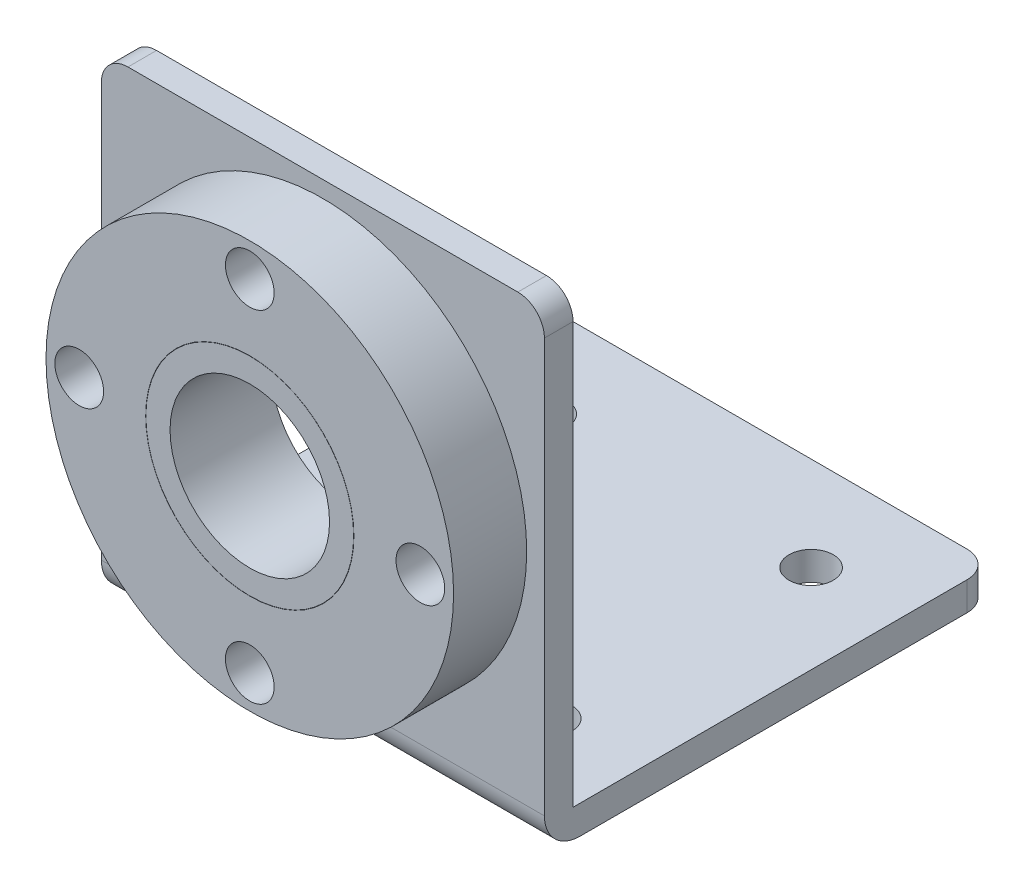
ISO-10303-21;
HEADER;
FILE_DESCRIPTION(('STEP AP214'),'2;1');
FILE_NAME('part.step','',(''),(''),'','','');
FILE_SCHEMA(('AUTOMOTIVE_DESIGN { 1 0 10303 214 1 1 1 1 }'));
ENDSEC;
DATA;
#1=APPLICATION_CONTEXT('core data for automotive mechanical design processes');
#2=APPLICATION_PROTOCOL_DEFINITION('international standard','automotive_design',2000,#1);
#3=PRODUCT_CONTEXT('',#1,'mechanical');
#4=PRODUCT('Part','Part','',(#3));
#5=PRODUCT_RELATED_PRODUCT_CATEGORY('part','',(#4));
#6=PRODUCT_DEFINITION_FORMATION('','',#4);
#7=PRODUCT_DEFINITION_CONTEXT('part definition',#1,'design');
#8=PRODUCT_DEFINITION('design','',#6,#7);
#9=PRODUCT_DEFINITION_SHAPE('','',#8);
#10=(LENGTH_UNIT() NAMED_UNIT(*) SI_UNIT(.MILLI.,.METRE.));
#11=(NAMED_UNIT(*) PLANE_ANGLE_UNIT() SI_UNIT($,.RADIAN.));
#12=(NAMED_UNIT(*) SI_UNIT($,.STERADIAN.) SOLID_ANGLE_UNIT());
#13=UNCERTAINTY_MEASURE_WITH_UNIT(LENGTH_MEASURE(1.E-05),#10,'distance_accuracy_value','');
#14=(GEOMETRIC_REPRESENTATION_CONTEXT(3) GLOBAL_UNCERTAINTY_ASSIGNED_CONTEXT((#13)) GLOBAL_UNIT_ASSIGNED_CONTEXT((#10,
#11,#12)) REPRESENTATION_CONTEXT('',''));
#15=CARTESIAN_POINT('',(0.,0.,0.));
#16=DIRECTION('',(0.,0.,1.));
#17=DIRECTION('',(1.,0.,0.));
#18=AXIS2_PLACEMENT_3D('',#15,#16,#17);
#19=CARTESIAN_POINT('',(0.,28.85,66.7633080376491));
#20=DIRECTION('',(0.,0.,-1.));
#21=DIRECTION('',(-1.,0.,0.));
#22=AXIS2_PLACEMENT_3D('',#19,#20,#21);
#23=CYLINDRICAL_SURFACE('',#22,11.725);
#24=CARTESIAN_POINT('',(0.,28.85,22.12));
#25=DIRECTION('',(0.,0.,-1.));
#26=DIRECTION('',(-1.,0.,0.));
#27=AXIS2_PLACEMENT_3D('',#24,#25,#26);
#28=CIRCLE('',#27,11.725);
#29=CARTESIAN_POINT('',(-11.725,28.85,22.12));
#30=VERTEX_POINT('',#29);
#31=EDGE_CURVE('E51',#30,#30,#28,.T.);
#32=ORIENTED_EDGE('',*,*,#31,.F.);
#33=EDGE_LOOP('',(#32));
#34=FACE_BOUND('',#33,.T.);
#35=CARTESIAN_POINT('',(0.,28.85,33.6));
#36=DIRECTION('',(0.,0.,1.));
#37=DIRECTION('',(1.,0.,0.));
#38=AXIS2_PLACEMENT_3D('',#35,#36,#37);
#39=CIRCLE('',#38,11.725);
#40=CARTESIAN_POINT('',(11.725,28.85,33.6));
#41=VERTEX_POINT('',#40);
#42=EDGE_CURVE('E47',#41,#41,#39,.F.);
#43=ORIENTED_EDGE('',*,*,#42,.T.);
#44=EDGE_LOOP('',(#43));
#45=FACE_BOUND('',#44,.T.);
#46=ADVANCED_FACE('F43',(#34,#45),#23,.T.);
#47=CARTESIAN_POINT('',(0.,28.85,66.7633080376491));
#48=DIRECTION('',(0.,0.,-1.));
#49=DIRECTION('',(-1.,0.,0.));
#50=AXIS2_PLACEMENT_3D('',#47,#48,#49);
#51=CYLINDRICAL_SURFACE('',#50,9.);
#52=CARTESIAN_POINT('',(0.,28.85,22.12));
#53=DIRECTION('',(0.,0.,-1.));
#54=DIRECTION('',(-1.,0.,0.));
#55=AXIS2_PLACEMENT_3D('',#52,#53,#54);
#56=CIRCLE('',#55,9.);
#57=CARTESIAN_POINT('',(-9.,28.85,22.12));
#58=VERTEX_POINT('',#57);
#59=EDGE_CURVE('E55',#58,#58,#56,.T.);
#60=ORIENTED_EDGE('',*,*,#59,.T.);
#61=EDGE_LOOP('',(#60));
#62=FACE_BOUND('',#61,.T.);
#63=CARTESIAN_POINT('',(0.,28.85,33.6));
#64=DIRECTION('',(0.,0.,1.));
#65=DIRECTION('',(1.,0.,0.));
#66=AXIS2_PLACEMENT_3D('',#63,#64,#65);
#67=CIRCLE('',#66,9.);
#68=CARTESIAN_POINT('',(9.,28.85,33.6));
#69=VERTEX_POINT('',#68);
#70=EDGE_CURVE('E11',#69,#69,#67,.F.);
#71=ORIENTED_EDGE('',*,*,#70,.F.);
#72=EDGE_LOOP('',(#71));
#73=FACE_BOUND('',#72,.T.);
#74=ADVANCED_FACE('F70',(#62,#73),#51,.F.);
#75=CARTESIAN_POINT('',(0.,28.85,22.12));
#76=DIRECTION('',(0.,0.,-1.));
#77=DIRECTION('',(-1.,0.,0.));
#78=AXIS2_PLACEMENT_3D('',#75,#76,#77);
#79=PLANE('',#78);
#80=ORIENTED_EDGE('',*,*,#59,.F.);
#81=EDGE_LOOP('',(#80));
#82=FACE_BOUND('',#81,.T.);
#83=ORIENTED_EDGE('',*,*,#31,.T.);
#84=EDGE_LOOP('',(#83));
#85=FACE_BOUND('',#84,.T.);
#86=ADVANCED_FACE('F66',(#82,#85),#79,.T.);
#87=CARTESIAN_POINT('',(0.,0.,33.6));
#88=DIRECTION('',(0.,0.,1.));
#89=DIRECTION('',(1.,0.,0.));
#90=AXIS2_PLACEMENT_3D('',#87,#88,#89);
#91=PLANE('',#90);
#92=ORIENTED_EDGE('',*,*,#42,.F.);
#93=EDGE_LOOP('',(#92));
#94=FACE_BOUND('',#93,.T.);
#95=ORIENTED_EDGE('',*,*,#70,.T.);
#96=EDGE_LOOP('',(#95));
#97=FACE_BOUND('',#96,.T.);
#98=ADVANCED_FACE('F45',(#94,#97),#91,.T.);
#99=CLOSED_SHELL('',(#46,#74,#86,#98));
#100=MANIFOLD_SOLID_BREP('B2',#99);
#101=CARTESIAN_POINT('',(-25.,3.23,25.35));
#102=DIRECTION('',(0.,0.,-1.));
#103=DIRECTION('',(-1.,0.,0.));
#104=AXIS2_PLACEMENT_3D('',#101,#102,#103);
#105=PLANE('',#104);
#106=DIRECTION('',(1.,0.,0.));
#107=VECTOR('',#106,1.);
#108=CARTESIAN_POINT('',(-25.,53.7,25.35));
#109=LINE('',#108,#107);
#110=CARTESIAN_POINT('',(-22.,53.7,25.35));
#111=VERTEX_POINT('',#110);
#112=CARTESIAN_POINT('',(22.,53.7,25.35));
#113=VERTEX_POINT('',#112);
#114=EDGE_CURVE('E215',#111,#113,#109,.T.);
#115=ORIENTED_EDGE('',*,*,#114,.F.);
#116=CARTESIAN_POINT('',(-22.,50.7,25.35));
#117=DIRECTION('',(0.,0.,-1.));
#118=DIRECTION('',(-1.,0.,0.));
#119=AXIS2_PLACEMENT_3D('',#116,#117,#118);
#120=CIRCLE('',#119,3.);
#121=CARTESIAN_POINT('',(-25.,50.7,25.35));
#122=VERTEX_POINT('',#121);
#123=EDGE_CURVE('E300',#111,#122,#120,.F.);
#124=ORIENTED_EDGE('',*,*,#123,.T.);
#125=DIRECTION('',(0.,-1.,0.));
#126=VECTOR('',#125,1.);
#127=CARTESIAN_POINT('',(-25.,3.23,25.35));
#128=LINE('',#127,#126);
#129=CARTESIAN_POINT('',(-25.,4.,25.35));
#130=VERTEX_POINT('',#129);
#131=EDGE_CURVE('E261',#122,#130,#128,.T.);
#132=ORIENTED_EDGE('',*,*,#131,.T.);
#133=DIRECTION('',(1.,0.,0.));
#134=VECTOR('',#133,1.);
#135=CARTESIAN_POINT('',(25.,4.,25.35));
#136=LINE('',#135,#134);
#137=CARTESIAN_POINT('',(25.,4.,25.35));
#138=VERTEX_POINT('',#137);
#139=EDGE_CURVE('E263',#130,#138,#136,.T.);
#140=ORIENTED_EDGE('',*,*,#139,.T.);
#141=DIRECTION('',(0.,-1.,0.));
#142=VECTOR('',#141,1.);
#143=CARTESIAN_POINT('',(25.,3.23,25.35));
#144=LINE('',#143,#142);
#145=CARTESIAN_POINT('',(25.,50.7,25.35));
#146=VERTEX_POINT('',#145);
#147=EDGE_CURVE('E202',#146,#138,#144,.T.);
#148=ORIENTED_EDGE('',*,*,#147,.F.);
#149=CARTESIAN_POINT('',(22.,50.7,25.35));
#150=DIRECTION('',(0.,0.,-1.));
#151=DIRECTION('',(-1.,0.,0.));
#152=AXIS2_PLACEMENT_3D('',#149,#150,#151);
#153=CIRCLE('',#152,3.);
#154=EDGE_CURVE('E298',#146,#113,#153,.F.);
#155=ORIENTED_EDGE('',*,*,#154,.T.);
#156=EDGE_LOOP('',(#115,#124,#132,#140,#148,#155));
#157=FACE_BOUND('',#156,.T.);
#158=CARTESIAN_POINT('',(0.,28.85,25.35));
#159=DIRECTION('',(0.,0.,-1.));
#160=DIRECTION('',(-1.,0.,0.));
#161=AXIS2_PLACEMENT_3D('',#158,#159,#160);
#162=CIRCLE('',#161,23.);
#163=CARTESIAN_POINT('',(-23.,28.85,25.35));
#164=VERTEX_POINT('',#163);
#165=EDGE_CURVE('E41',#164,#164,#162,.F.);
#166=ORIENTED_EDGE('',*,*,#165,.F.);
#167=EDGE_LOOP('',(#166));
#168=FACE_BOUND('',#167,.T.);
#169=ADVANCED_FACE('F104',(#157,#168),#105,.F.);
#170=CARTESIAN_POINT('',(0.,3.23,0.));
#171=DIRECTION('',(0.,-1.,0.));
#172=DIRECTION('',(0.,0.,-1.));
#173=AXIS2_PLACEMENT_3D('',#170,#171,#172);
#174=PLANE('',#173);
#175=CARTESIAN_POINT('',(-15.,3.23,-14.75));
#176=DIRECTION('',(0.,1.,0.));
#177=DIRECTION('',(0.,0.,1.));
#178=AXIS2_PLACEMENT_3D('',#175,#176,#177);
#179=CIRCLE('',#178,2.5);
#180=CARTESIAN_POINT('',(-15.,3.23,-12.25));
#181=VERTEX_POINT('',#180);
#182=EDGE_CURVE('E226',#181,#181,#179,.T.);
#183=ORIENTED_EDGE('',*,*,#182,.F.);
#184=EDGE_LOOP('',(#183));
#185=FACE_BOUND('',#184,.T.);
#186=CARTESIAN_POINT('',(-15.,3.23,14.75));
#187=DIRECTION('',(0.,1.,0.));
#188=DIRECTION('',(0.,0.,-1.));
#189=AXIS2_PLACEMENT_3D('',#186,#187,#188);
#190=CIRCLE('',#189,2.5);
#191=CARTESIAN_POINT('',(-15.,3.23,12.25));
#192=VERTEX_POINT('',#191);
#193=EDGE_CURVE('E232',#192,#192,#190,.T.);
#194=ORIENTED_EDGE('',*,*,#193,.F.);
#195=EDGE_LOOP('',(#194));
#196=FACE_BOUND('',#195,.T.);
#197=CARTESIAN_POINT('',(15.,3.23,-14.75));
#198=DIRECTION('',(0.,1.,0.));
#199=DIRECTION('',(0.,0.,-1.));
#200=AXIS2_PLACEMENT_3D('',#197,#198,#199);
#201=CIRCLE('',#200,2.5);
#202=CARTESIAN_POINT('',(15.,3.23,-17.25));
#203=VERTEX_POINT('',#202);
#204=EDGE_CURVE('E238',#203,#203,#201,.T.);
#205=ORIENTED_EDGE('',*,*,#204,.F.);
#206=EDGE_LOOP('',(#205));
#207=FACE_BOUND('',#206,.T.);
#208=CARTESIAN_POINT('',(15.,3.23,14.75));
#209=DIRECTION('',(0.,1.,0.));
#210=DIRECTION('',(0.,0.,1.));
#211=AXIS2_PLACEMENT_3D('',#208,#209,#210);
#212=CIRCLE('',#211,2.5);
#213=CARTESIAN_POINT('',(15.,3.23,17.25));
#214=VERTEX_POINT('',#213);
#215=EDGE_CURVE('E244',#214,#214,#212,.T.);
#216=ORIENTED_EDGE('',*,*,#215,.F.);
#217=EDGE_LOOP('',(#216));
#218=FACE_BOUND('',#217,.T.);
#219=DIRECTION('',(-1.,0.,0.));
#220=VECTOR('',#219,1.);
#221=CARTESIAN_POINT('',(-25.,3.23,-25.35));
#222=LINE('',#221,#220);
#223=CARTESIAN_POINT('',(22.,3.23,-25.35));
#224=VERTEX_POINT('',#223);
#225=CARTESIAN_POINT('',(-22.,3.23,-25.35));
#226=VERTEX_POINT('',#225);
#227=EDGE_CURVE('E203',#224,#226,#222,.T.);
#228=ORIENTED_EDGE('',*,*,#227,.T.);
#229=CARTESIAN_POINT('',(-22.,3.23,-22.35));
#230=DIRECTION('',(0.,-1.,0.));
#231=DIRECTION('',(0.,0.,-1.));
#232=AXIS2_PLACEMENT_3D('',#229,#230,#231);
#233=CIRCLE('',#232,3.);
#234=CARTESIAN_POINT('',(-25.,3.23,-22.35));
#235=VERTEX_POINT('',#234);
#236=EDGE_CURVE('E198',#226,#235,#233,.F.);
#237=ORIENTED_EDGE('',*,*,#236,.T.);
#238=DIRECTION('',(0.,0.,1.));
#239=VECTOR('',#238,1.);
#240=CARTESIAN_POINT('',(-25.,3.23,25.35));
#241=LINE('',#240,#239);
#242=CARTESIAN_POINT('',(-25.,3.23,22.12));
#243=VERTEX_POINT('',#242);
#244=EDGE_CURVE('E189',#235,#243,#241,.T.);
#245=ORIENTED_EDGE('',*,*,#244,.T.);
#246=DIRECTION('',(-1.,0.,0.));
#247=VECTOR('',#246,1.);
#248=CARTESIAN_POINT('',(-25.,3.23,22.12));
#249=LINE('',#248,#247);
#250=CARTESIAN_POINT('',(25.,3.23,22.12));
#251=VERTEX_POINT('',#250);
#252=EDGE_CURVE('E195',#251,#243,#249,.T.);
#253=ORIENTED_EDGE('',*,*,#252,.F.);
#254=DIRECTION('',(0.,0.,-1.));
#255=VECTOR('',#254,1.);
#256=CARTESIAN_POINT('',(25.,3.23,25.35));
#257=LINE('',#256,#255);
#258=CARTESIAN_POINT('',(25.,3.23,-22.35));
#259=VERTEX_POINT('',#258);
#260=EDGE_CURVE('E250',#251,#259,#257,.T.);
#261=ORIENTED_EDGE('',*,*,#260,.T.);
#262=CARTESIAN_POINT('',(22.,3.23,-22.35));
#263=DIRECTION('',(0.,-1.,0.));
#264=DIRECTION('',(0.,0.,-1.));
#265=AXIS2_PLACEMENT_3D('',#262,#263,#264);
#266=CIRCLE('',#265,3.);
#267=EDGE_CURVE('E286',#259,#224,#266,.F.);
#268=ORIENTED_EDGE('',*,*,#267,.T.);
#269=EDGE_LOOP('',(#228,#237,#245,#253,#261,#268));
#270=FACE_BOUND('',#269,.T.);
#271=ADVANCED_FACE('F192',(#185,#196,#207,#218,#270),#174,.F.);
#272=CARTESIAN_POINT('',(0.,0.,0.));
#273=DIRECTION('',(0.,-1.,0.));
#274=DIRECTION('',(0.,0.,-1.));
#275=AXIS2_PLACEMENT_3D('',#272,#273,#274);
#276=PLANE('',#275);
#277=CARTESIAN_POINT('',(-15.,0.,14.75));
#278=DIRECTION('',(0.,1.,0.));
#279=DIRECTION('',(0.,0.,-1.));
#280=AXIS2_PLACEMENT_3D('',#277,#278,#279);
#281=CIRCLE('',#280,2.5);
#282=CARTESIAN_POINT('',(-15.,0.,12.25));
#283=VERTEX_POINT('',#282);
#284=EDGE_CURVE('E229',#283,#283,#281,.T.);
#285=ORIENTED_EDGE('',*,*,#284,.T.);
#286=EDGE_LOOP('',(#285));
#287=FACE_BOUND('',#286,.T.);
#288=CARTESIAN_POINT('',(15.,0.,14.75));
#289=DIRECTION('',(0.,1.,0.));
#290=DIRECTION('',(0.,0.,1.));
#291=AXIS2_PLACEMENT_3D('',#288,#289,#290);
#292=CIRCLE('',#291,2.5);
#293=CARTESIAN_POINT('',(15.,0.,17.25));
#294=VERTEX_POINT('',#293);
#295=EDGE_CURVE('E241',#294,#294,#292,.T.);
#296=ORIENTED_EDGE('',*,*,#295,.T.);
#297=EDGE_LOOP('',(#296));
#298=FACE_BOUND('',#297,.T.);
#299=DIRECTION('',(0.,0.,1.));
#300=VECTOR('',#299,1.);
#301=CARTESIAN_POINT('',(-25.,0.,25.35));
#302=LINE('',#301,#300);
#303=CARTESIAN_POINT('',(-25.,0.,-22.35));
#304=VERTEX_POINT('',#303);
#305=CARTESIAN_POINT('',(-25.,0.,21.35));
#306=VERTEX_POINT('',#305);
#307=EDGE_CURVE('E252',#304,#306,#302,.T.);
#308=ORIENTED_EDGE('',*,*,#307,.F.);
#309=CARTESIAN_POINT('',(-22.,0.,-22.35));
#310=DIRECTION('',(0.,-1.,0.));
#311=DIRECTION('',(0.,0.,-1.));
#312=AXIS2_PLACEMENT_3D('',#309,#310,#311);
#313=CIRCLE('',#312,3.);
#314=CARTESIAN_POINT('',(-22.,0.,-25.35));
#315=VERTEX_POINT('',#314);
#316=EDGE_CURVE('E279',#304,#315,#313,.T.);
#317=ORIENTED_EDGE('',*,*,#316,.T.);
#318=DIRECTION('',(-1.,0.,0.));
#319=VECTOR('',#318,1.);
#320=CARTESIAN_POINT('',(-25.,0.,-25.35));
#321=LINE('',#320,#319);
#322=CARTESIAN_POINT('',(22.,0.,-25.35));
#323=VERTEX_POINT('',#322);
#324=EDGE_CURVE('E256',#323,#315,#321,.T.);
#325=ORIENTED_EDGE('',*,*,#324,.F.);
#326=CARTESIAN_POINT('',(22.,0.,-22.35));
#327=DIRECTION('',(0.,-1.,0.));
#328=DIRECTION('',(0.,0.,-1.));
#329=AXIS2_PLACEMENT_3D('',#326,#327,#328);
#330=CIRCLE('',#329,3.);
#331=CARTESIAN_POINT('',(25.,0.,-22.35));
#332=VERTEX_POINT('',#331);
#333=EDGE_CURVE('E277',#323,#332,#330,.T.);
#334=ORIENTED_EDGE('',*,*,#333,.T.);
#335=DIRECTION('',(0.,0.,-1.));
#336=VECTOR('',#335,1.);
#337=CARTESIAN_POINT('',(25.,0.,25.35));
#338=LINE('',#337,#336);
#339=CARTESIAN_POINT('',(25.,0.,21.35));
#340=VERTEX_POINT('',#339);
#341=EDGE_CURVE('E247',#340,#332,#338,.T.);
#342=ORIENTED_EDGE('',*,*,#341,.F.);
#343=DIRECTION('',(1.,0.,0.));
#344=VECTOR('',#343,1.);
#345=CARTESIAN_POINT('',(-25.,0.,21.35));
#346=LINE('',#345,#344);
#347=EDGE_CURVE('E268',#340,#306,#346,.F.);
#348=ORIENTED_EDGE('',*,*,#347,.T.);
#349=EDGE_LOOP('',(#308,#317,#325,#334,#342,#348));
#350=FACE_BOUND('',#349,.T.);
#351=CARTESIAN_POINT('',(15.,0.,-14.75));
#352=DIRECTION('',(0.,1.,0.));
#353=DIRECTION('',(0.,0.,-1.));
#354=AXIS2_PLACEMENT_3D('',#351,#352,#353);
#355=CIRCLE('',#354,2.5);
#356=CARTESIAN_POINT('',(15.,0.,-17.25));
#357=VERTEX_POINT('',#356);
#358=EDGE_CURVE('E235',#357,#357,#355,.T.);
#359=ORIENTED_EDGE('',*,*,#358,.T.);
#360=EDGE_LOOP('',(#359));
#361=FACE_BOUND('',#360,.T.);
#362=CARTESIAN_POINT('',(-15.,0.,-14.75));
#363=DIRECTION('',(0.,1.,0.));
#364=DIRECTION('',(0.,0.,1.));
#365=AXIS2_PLACEMENT_3D('',#362,#363,#364);
#366=CIRCLE('',#365,2.5);
#367=CARTESIAN_POINT('',(-15.,0.,-12.25));
#368=VERTEX_POINT('',#367);
#369=EDGE_CURVE('E225',#368,#368,#366,.T.);
#370=ORIENTED_EDGE('',*,*,#369,.T.);
#371=EDGE_LOOP('',(#370));
#372=FACE_BOUND('',#371,.T.);
#373=ADVANCED_FACE('F366',(#287,#298,#350,#361,#372),#276,.T.);
#374=CARTESIAN_POINT('',(25.,3.23,25.35));
#375=DIRECTION('',(-1.,0.,0.));
#376=DIRECTION('',(0.,0.,1.));
#377=AXIS2_PLACEMENT_3D('',#374,#375,#376);
#378=PLANE('',#377);
#379=ORIENTED_EDGE('',*,*,#341,.T.);
#380=DIRECTION('',(0.,-1.,0.));
#381=VECTOR('',#380,1.);
#382=CARTESIAN_POINT('',(25.,3.23,-22.35));
#383=LINE('',#382,#381);
#384=EDGE_CURVE('E291',#332,#259,#383,.F.);
#385=ORIENTED_EDGE('',*,*,#384,.T.);
#386=ORIENTED_EDGE('',*,*,#260,.F.);
#387=DIRECTION('',(0.,-1.,0.));
#388=VECTOR('',#387,1.);
#389=CARTESIAN_POINT('',(25.,53.7,22.12));
#390=LINE('',#389,#388);
#391=CARTESIAN_POINT('',(25.,50.7,22.12));
#392=VERTEX_POINT('',#391);
#393=EDGE_CURVE('E210',#392,#251,#390,.T.);
#394=ORIENTED_EDGE('',*,*,#393,.F.);
#395=DIRECTION('',(0.,0.,-1.));
#396=VECTOR('',#395,1.);
#397=CARTESIAN_POINT('',(25.,50.7,25.35));
#398=LINE('',#397,#396);
#399=EDGE_CURVE('E289',#392,#146,#398,.F.);
#400=ORIENTED_EDGE('',*,*,#399,.T.);
#401=ORIENTED_EDGE('',*,*,#147,.T.);
#402=CARTESIAN_POINT('',(25.,4.,21.35));
#403=DIRECTION('',(-1.,0.,0.));
#404=DIRECTION('',(0.,0.,1.));
#405=AXIS2_PLACEMENT_3D('',#402,#403,#404);
#406=CIRCLE('',#405,4.);
#407=EDGE_CURVE('E266',#138,#340,#406,.F.);
#408=ORIENTED_EDGE('',*,*,#407,.T.);
#409=EDGE_LOOP('',(#379,#385,#386,#394,#400,#401,#408));
#410=FACE_BOUND('',#409,.T.);
#411=ADVANCED_FACE('F379',(#410),#378,.F.);
#412=CARTESIAN_POINT('',(-25.,3.23,-25.35));
#413=DIRECTION('',(0.,0.,1.));
#414=DIRECTION('',(1.,0.,0.));
#415=AXIS2_PLACEMENT_3D('',#412,#413,#414);
#416=PLANE('',#415);
#417=ORIENTED_EDGE('',*,*,#324,.T.);
#418=DIRECTION('',(0.,-1.,0.));
#419=VECTOR('',#418,1.);
#420=CARTESIAN_POINT('',(-22.,3.23,-25.35));
#421=LINE('',#420,#419);
#422=EDGE_CURVE('E284',#315,#226,#421,.F.);
#423=ORIENTED_EDGE('',*,*,#422,.T.);
#424=ORIENTED_EDGE('',*,*,#227,.F.);
#425=DIRECTION('',(0.,-1.,0.));
#426=VECTOR('',#425,1.);
#427=CARTESIAN_POINT('',(22.,3.23,-25.35));
#428=LINE('',#427,#426);
#429=EDGE_CURVE('E281',#224,#323,#428,.T.);
#430=ORIENTED_EDGE('',*,*,#429,.T.);
#431=EDGE_LOOP('',(#417,#423,#424,#430));
#432=FACE_BOUND('',#431,.T.);
#433=ADVANCED_FACE('F376',(#432),#416,.F.);
#434=CARTESIAN_POINT('',(-25.,3.23,25.35));
#435=DIRECTION('',(1.,0.,0.));
#436=DIRECTION('',(0.,0.,-1.));
#437=AXIS2_PLACEMENT_3D('',#434,#435,#436);
#438=PLANE('',#437);
#439=ORIENTED_EDGE('',*,*,#244,.F.);
#440=DIRECTION('',(0.,-1.,0.));
#441=VECTOR('',#440,1.);
#442=CARTESIAN_POINT('',(-25.,3.23,-22.35));
#443=LINE('',#442,#441);
#444=EDGE_CURVE('E275',#235,#304,#443,.T.);
#445=ORIENTED_EDGE('',*,*,#444,.T.);
#446=ORIENTED_EDGE('',*,*,#307,.T.);
#447=CARTESIAN_POINT('',(-25.,4.,21.35));
#448=DIRECTION('',(1.,0.,0.));
#449=DIRECTION('',(0.,0.,-1.));
#450=AXIS2_PLACEMENT_3D('',#447,#448,#449);
#451=CIRCLE('',#450,4.);
#452=EDGE_CURVE('E271',#306,#130,#451,.F.);
#453=ORIENTED_EDGE('',*,*,#452,.T.);
#454=ORIENTED_EDGE('',*,*,#131,.F.);
#455=DIRECTION('',(0.,0.,1.));
#456=VECTOR('',#455,1.);
#457=CARTESIAN_POINT('',(-25.,50.7,25.35));
#458=LINE('',#457,#456);
#459=CARTESIAN_POINT('',(-25.,50.7,22.12));
#460=VERTEX_POINT('',#459);
#461=EDGE_CURVE('E209',#122,#460,#458,.F.);
#462=ORIENTED_EDGE('',*,*,#461,.T.);
#463=DIRECTION('',(0.,-1.,0.));
#464=VECTOR('',#463,1.);
#465=CARTESIAN_POINT('',(-25.,53.7,22.12));
#466=LINE('',#465,#464);
#467=EDGE_CURVE('E205',#460,#243,#466,.T.);
#468=ORIENTED_EDGE('',*,*,#467,.T.);
#469=EDGE_LOOP('',(#439,#445,#446,#453,#454,#462,#468));
#470=FACE_BOUND('',#469,.T.);
#471=ADVANCED_FACE('F206',(#470),#438,.F.);
#472=CARTESIAN_POINT('',(15.,3.23,14.75));
#473=DIRECTION('',(0.,-1.,0.));
#474=DIRECTION('',(0.,0.,-1.));
#475=AXIS2_PLACEMENT_3D('',#472,#473,#474);
#476=CYLINDRICAL_SURFACE('',#475,2.5);
#477=ORIENTED_EDGE('',*,*,#215,.T.);
#478=EDGE_LOOP('',(#477));
#479=FACE_BOUND('',#478,.T.);
#480=ORIENTED_EDGE('',*,*,#295,.F.);
#481=EDGE_LOOP('',(#480));
#482=FACE_BOUND('',#481,.T.);
#483=ADVANCED_FACE('F375',(#479,#482),#476,.F.);
#484=CARTESIAN_POINT('',(15.,3.23,-14.75));
#485=DIRECTION('',(0.,-1.,0.));
#486=DIRECTION('',(0.,0.,-1.));
#487=AXIS2_PLACEMENT_3D('',#484,#485,#486);
#488=CYLINDRICAL_SURFACE('',#487,2.5);
#489=ORIENTED_EDGE('',*,*,#204,.T.);
#490=EDGE_LOOP('',(#489));
#491=FACE_BOUND('',#490,.T.);
#492=ORIENTED_EDGE('',*,*,#358,.F.);
#493=EDGE_LOOP('',(#492));
#494=FACE_BOUND('',#493,.T.);
#495=ADVANCED_FACE('F438',(#491,#494),#488,.F.);
#496=CARTESIAN_POINT('',(-15.,3.23,14.75));
#497=DIRECTION('',(0.,-1.,0.));
#498=DIRECTION('',(0.,0.,-1.));
#499=AXIS2_PLACEMENT_3D('',#496,#497,#498);
#500=CYLINDRICAL_SURFACE('',#499,2.5);
#501=ORIENTED_EDGE('',*,*,#193,.T.);
#502=EDGE_LOOP('',(#501));
#503=FACE_BOUND('',#502,.T.);
#504=ORIENTED_EDGE('',*,*,#284,.F.);
#505=EDGE_LOOP('',(#504));
#506=FACE_BOUND('',#505,.T.);
#507=ADVANCED_FACE('F429',(#503,#506),#500,.F.);
#508=CARTESIAN_POINT('',(-15.,3.23,-14.75));
#509=DIRECTION('',(0.,-1.,0.));
#510=DIRECTION('',(0.,0.,-1.));
#511=AXIS2_PLACEMENT_3D('',#508,#509,#510);
#512=CYLINDRICAL_SURFACE('',#511,2.5);
#513=ORIENTED_EDGE('',*,*,#182,.T.);
#514=EDGE_LOOP('',(#513));
#515=FACE_BOUND('',#514,.T.);
#516=ORIENTED_EDGE('',*,*,#369,.F.);
#517=EDGE_LOOP('',(#516));
#518=FACE_BOUND('',#517,.T.);
#519=ADVANCED_FACE('F427',(#515,#518),#512,.F.);
#520=CARTESIAN_POINT('',(-25.,53.7,22.12));
#521=DIRECTION('',(0.,0.,1.));
#522=DIRECTION('',(1.,0.,0.));
#523=AXIS2_PLACEMENT_3D('',#520,#521,#522);
#524=PLANE('',#523);
#525=CARTESIAN_POINT('',(-19.2499999999995,28.8499999999997,22.12));
#526=DIRECTION('',(0.,0.,1.));
#527=DIRECTION('',(1.,0.,0.));
#528=AXIS2_PLACEMENT_3D('',#525,#526,#527);
#529=CIRCLE('',#528,2.75);
#530=CARTESIAN_POINT('',(-16.4999999999995,28.8499999999997,22.12));
#531=VERTEX_POINT('',#530);
#532=EDGE_CURVE('E216',#531,#531,#529,.T.);
#533=ORIENTED_EDGE('',*,*,#532,.T.);
#534=EDGE_LOOP('',(#533));
#535=FACE_BOUND('',#534,.T.);
#536=CARTESIAN_POINT('',(0.,28.85,22.12));
#537=DIRECTION('',(0.,0.,1.));
#538=DIRECTION('',(1.,0.,0.));
#539=AXIS2_PLACEMENT_3D('',#536,#537,#538);
#540=CIRCLE('',#539,11.75);
#541=CARTESIAN_POINT('',(11.75,28.85,22.12));
#542=VERTEX_POINT('',#541);
#543=EDGE_CURVE('E221',#542,#542,#540,.T.);
#544=ORIENTED_EDGE('',*,*,#543,.T.);
#545=EDGE_LOOP('',(#544));
#546=FACE_BOUND('',#545,.T.);
#547=CARTESIAN_POINT('',(9.5342724846754E-13,9.6,22.12));
#548=DIRECTION('',(0.,0.,1.));
#549=DIRECTION('',(1.,0.,0.));
#550=AXIS2_PLACEMENT_3D('',#547,#548,#549);
#551=CIRCLE('',#550,2.75);
#552=CARTESIAN_POINT('',(2.75000000000095,9.6,22.12));
#553=VERTEX_POINT('',#552);
#554=EDGE_CURVE('E311',#553,#553,#551,.T.);
#555=ORIENTED_EDGE('',*,*,#554,.T.);
#556=EDGE_LOOP('',(#555));
#557=FACE_BOUND('',#556,.T.);
#558=CARTESIAN_POINT('',(0.,48.1,22.12));
#559=DIRECTION('',(0.,0.,1.));
#560=DIRECTION('',(1.,0.,0.));
#561=AXIS2_PLACEMENT_3D('',#558,#559,#560);
#562=CIRCLE('',#561,2.75);
#563=CARTESIAN_POINT('',(2.75,48.1,22.12));
#564=VERTEX_POINT('',#563);
#565=EDGE_CURVE('E307',#564,#564,#562,.T.);
#566=ORIENTED_EDGE('',*,*,#565,.T.);
#567=EDGE_LOOP('',(#566));
#568=FACE_BOUND('',#567,.T.);
#569=CARTESIAN_POINT('',(19.2500000000005,28.8500000000005,22.12));
#570=DIRECTION('',(0.,0.,1.));
#571=DIRECTION('',(1.,0.,0.));
#572=AXIS2_PLACEMENT_3D('',#569,#570,#571);
#573=CIRCLE('',#572,2.75);
#574=CARTESIAN_POINT('',(22.0000000000005,28.8500000000005,22.12));
#575=VERTEX_POINT('',#574);
#576=EDGE_CURVE('E304',#575,#575,#573,.T.);
#577=ORIENTED_EDGE('',*,*,#576,.T.);
#578=EDGE_LOOP('',(#577));
#579=FACE_BOUND('',#578,.T.);
#580=ORIENTED_EDGE('',*,*,#467,.F.);
#581=CARTESIAN_POINT('',(-22.,50.7,22.12));
#582=DIRECTION('',(0.,0.,1.));
#583=DIRECTION('',(1.,0.,0.));
#584=AXIS2_PLACEMENT_3D('',#581,#582,#583);
#585=CIRCLE('',#584,3.);
#586=CARTESIAN_POINT('',(-22.,53.7,22.12));
#587=VERTEX_POINT('',#586);
#588=EDGE_CURVE('E112',#460,#587,#585,.F.);
#589=ORIENTED_EDGE('',*,*,#588,.T.);
#590=DIRECTION('',(-1.,0.,0.));
#591=VECTOR('',#590,1.);
#592=CARTESIAN_POINT('',(-25.,53.7,22.12));
#593=LINE('',#592,#591);
#594=CARTESIAN_POINT('',(22.,53.7,22.12));
#595=VERTEX_POINT('',#594);
#596=EDGE_CURVE('E211',#595,#587,#593,.T.);
#597=ORIENTED_EDGE('',*,*,#596,.F.);
#598=CARTESIAN_POINT('',(22.,50.7,22.12));
#599=DIRECTION('',(0.,0.,1.));
#600=DIRECTION('',(1.,0.,0.));
#601=AXIS2_PLACEMENT_3D('',#598,#599,#600);
#602=CIRCLE('',#601,3.);
#603=EDGE_CURVE('E126',#595,#392,#602,.F.);
#604=ORIENTED_EDGE('',*,*,#603,.T.);
#605=ORIENTED_EDGE('',*,*,#393,.T.);
#606=ORIENTED_EDGE('',*,*,#252,.T.);
#607=EDGE_LOOP('',(#580,#589,#597,#604,#605,#606));
#608=FACE_BOUND('',#607,.T.);
#609=ADVANCED_FACE('F213',(#535,#546,#557,#568,#579,#608),#524,.F.);
#610=CARTESIAN_POINT('',(0.,53.7,0.));
#611=DIRECTION('',(0.,-1.,0.));
#612=DIRECTION('',(0.,0.,-1.));
#613=AXIS2_PLACEMENT_3D('',#610,#611,#612);
#614=PLANE('',#613);
#615=ORIENTED_EDGE('',*,*,#596,.T.);
#616=DIRECTION('',(0.,0.,1.));
#617=VECTOR('',#616,1.);
#618=CARTESIAN_POINT('',(-22.,53.7,0.));
#619=LINE('',#618,#617);
#620=EDGE_CURVE('E295',#587,#111,#619,.T.);
#621=ORIENTED_EDGE('',*,*,#620,.T.);
#622=ORIENTED_EDGE('',*,*,#114,.T.);
#623=DIRECTION('',(0.,0.,-1.));
#624=VECTOR('',#623,1.);
#625=CARTESIAN_POINT('',(22.,53.7,0.));
#626=LINE('',#625,#624);
#627=EDGE_CURVE('E293',#113,#595,#626,.T.);
#628=ORIENTED_EDGE('',*,*,#627,.T.);
#629=EDGE_LOOP('',(#615,#621,#622,#628));
#630=FACE_BOUND('',#629,.T.);
#631=ADVANCED_FACE('F388',(#630),#614,.F.);
#632=CARTESIAN_POINT('',(-25.,4.,21.35));
#633=DIRECTION('',(-1.,0.,0.));
#634=DIRECTION('',(0.,0.,1.));
#635=AXIS2_PLACEMENT_3D('',#632,#633,#634);
#636=CYLINDRICAL_SURFACE('',#635,4.);
#637=ORIENTED_EDGE('',*,*,#452,.F.);
#638=ORIENTED_EDGE('',*,*,#347,.F.);
#639=ORIENTED_EDGE('',*,*,#407,.F.);
#640=ORIENTED_EDGE('',*,*,#139,.F.);
#641=EDGE_LOOP('',(#637,#638,#639,#640));
#642=FACE_BOUND('',#641,.T.);
#643=ADVANCED_FACE('F384',(#642),#636,.T.);
#644=CARTESIAN_POINT('',(-22.,3.23,-22.35));
#645=DIRECTION('',(0.,-1.,0.));
#646=DIRECTION('',(0.,0.,-1.));
#647=AXIS2_PLACEMENT_3D('',#644,#645,#646);
#648=CYLINDRICAL_SURFACE('',#647,3.);
#649=ORIENTED_EDGE('',*,*,#236,.F.);
#650=ORIENTED_EDGE('',*,*,#422,.F.);
#651=ORIENTED_EDGE('',*,*,#316,.F.);
#652=ORIENTED_EDGE('',*,*,#444,.F.);
#653=EDGE_LOOP('',(#649,#650,#651,#652));
#654=FACE_BOUND('',#653,.T.);
#655=ADVANCED_FACE('F387',(#654),#648,.T.);
#656=CARTESIAN_POINT('',(22.,3.23,-22.35));
#657=DIRECTION('',(0.,-1.,0.));
#658=DIRECTION('',(0.,0.,-1.));
#659=AXIS2_PLACEMENT_3D('',#656,#657,#658);
#660=CYLINDRICAL_SURFACE('',#659,3.);
#661=ORIENTED_EDGE('',*,*,#267,.F.);
#662=ORIENTED_EDGE('',*,*,#384,.F.);
#663=ORIENTED_EDGE('',*,*,#333,.F.);
#664=ORIENTED_EDGE('',*,*,#429,.F.);
#665=EDGE_LOOP('',(#661,#662,#663,#664));
#666=FACE_BOUND('',#665,.T.);
#667=ADVANCED_FACE('F392',(#666),#660,.T.);
#668=CARTESIAN_POINT('',(-22.,50.7,0.));
#669=DIRECTION('',(0.,0.,1.));
#670=DIRECTION('',(1.,0.,0.));
#671=AXIS2_PLACEMENT_3D('',#668,#669,#670);
#672=CYLINDRICAL_SURFACE('',#671,3.);
#673=ORIENTED_EDGE('',*,*,#588,.F.);
#674=ORIENTED_EDGE('',*,*,#461,.F.);
#675=ORIENTED_EDGE('',*,*,#123,.F.);
#676=ORIENTED_EDGE('',*,*,#620,.F.);
#677=EDGE_LOOP('',(#673,#674,#675,#676));
#678=FACE_BOUND('',#677,.T.);
#679=ADVANCED_FACE('F395',(#678),#672,.T.);
#680=CARTESIAN_POINT('',(22.,50.7,0.));
#681=DIRECTION('',(0.,0.,-1.));
#682=DIRECTION('',(-1.,0.,0.));
#683=AXIS2_PLACEMENT_3D('',#680,#681,#682);
#684=CYLINDRICAL_SURFACE('',#683,3.);
#685=ORIENTED_EDGE('',*,*,#154,.F.);
#686=ORIENTED_EDGE('',*,*,#399,.F.);
#687=ORIENTED_EDGE('',*,*,#603,.F.);
#688=ORIENTED_EDGE('',*,*,#627,.F.);
#689=EDGE_LOOP('',(#685,#686,#687,#688));
#690=FACE_BOUND('',#689,.T.);
#691=ADVANCED_FACE('F106',(#690),#684,.T.);
#692=CARTESIAN_POINT('',(19.2500000000005,28.8500000000005,-25.35));
#693=DIRECTION('',(0.,0.,1.));
#694=DIRECTION('',(1.,0.,0.));
#695=AXIS2_PLACEMENT_3D('',#692,#693,#694);
#696=CYLINDRICAL_SURFACE('',#695,2.75);
#697=ORIENTED_EDGE('',*,*,#576,.F.);
#698=EDGE_LOOP('',(#697));
#699=FACE_BOUND('',#698,.T.);
#700=CARTESIAN_POINT('',(19.2500000000005,28.8500000000005,33.6));
#701=DIRECTION('',(0.,0.,1.));
#702=DIRECTION('',(1.,0.,0.));
#703=AXIS2_PLACEMENT_3D('',#700,#701,#702);
#704=CIRCLE('',#703,2.75);
#705=CARTESIAN_POINT('',(22.0000000000005,28.8500000000005,33.6));
#706=VERTEX_POINT('',#705);
#707=EDGE_CURVE('E333',#706,#706,#704,.T.);
#708=ORIENTED_EDGE('',*,*,#707,.T.);
#709=EDGE_LOOP('',(#708));
#710=FACE_BOUND('',#709,.T.);
#711=ADVANCED_FACE('F402',(#699,#710),#696,.F.);
#712=CARTESIAN_POINT('',(0.,48.1,-25.35));
#713=DIRECTION('',(0.,0.,1.));
#714=DIRECTION('',(1.,0.,0.));
#715=AXIS2_PLACEMENT_3D('',#712,#713,#714);
#716=CYLINDRICAL_SURFACE('',#715,2.75);
#717=ORIENTED_EDGE('',*,*,#565,.F.);
#718=EDGE_LOOP('',(#717));
#719=FACE_BOUND('',#718,.T.);
#720=CARTESIAN_POINT('',(0.,48.1,33.6));
#721=DIRECTION('',(0.,0.,1.));
#722=DIRECTION('',(1.,0.,0.));
#723=AXIS2_PLACEMENT_3D('',#720,#721,#722);
#724=CIRCLE('',#723,2.75);
#725=CARTESIAN_POINT('',(2.75,48.1,33.6));
#726=VERTEX_POINT('',#725);
#727=EDGE_CURVE('E330',#726,#726,#724,.T.);
#728=ORIENTED_EDGE('',*,*,#727,.T.);
#729=EDGE_LOOP('',(#728));
#730=FACE_BOUND('',#729,.T.);
#731=ADVANCED_FACE('F561',(#719,#730),#716,.F.);
#732=CARTESIAN_POINT('',(9.5342724846754E-13,9.6,-25.35));
#733=DIRECTION('',(0.,0.,1.));
#734=DIRECTION('',(1.,0.,0.));
#735=AXIS2_PLACEMENT_3D('',#732,#733,#734);
#736=CYLINDRICAL_SURFACE('',#735,2.75);
#737=ORIENTED_EDGE('',*,*,#554,.F.);
#738=EDGE_LOOP('',(#737));
#739=FACE_BOUND('',#738,.T.);
#740=CARTESIAN_POINT('',(9.5342724846754E-13,9.6,33.6));
#741=DIRECTION('',(0.,0.,1.));
#742=DIRECTION('',(1.,0.,0.));
#743=AXIS2_PLACEMENT_3D('',#740,#741,#742);
#744=CIRCLE('',#743,2.75);
#745=CARTESIAN_POINT('',(2.75000000000095,9.6,33.6));
#746=VERTEX_POINT('',#745);
#747=EDGE_CURVE('E329',#746,#746,#744,.T.);
#748=ORIENTED_EDGE('',*,*,#747,.T.);
#749=EDGE_LOOP('',(#748));
#750=FACE_BOUND('',#749,.T.);
#751=ADVANCED_FACE('F323',(#739,#750),#736,.F.);
#752=CARTESIAN_POINT('',(0.,28.85,-25.35));
#753=DIRECTION('',(0.,0.,1.));
#754=DIRECTION('',(1.,0.,0.));
#755=AXIS2_PLACEMENT_3D('',#752,#753,#754);
#756=CYLINDRICAL_SURFACE('',#755,11.75);
#757=ORIENTED_EDGE('',*,*,#543,.F.);
#758=EDGE_LOOP('',(#757));
#759=FACE_BOUND('',#758,.T.);
#760=CARTESIAN_POINT('',(0.,28.85,33.6));
#761=DIRECTION('',(0.,0.,1.));
#762=DIRECTION('',(1.,0.,0.));
#763=AXIS2_PLACEMENT_3D('',#760,#761,#762);
#764=CIRCLE('',#763,11.75);
#765=CARTESIAN_POINT('',(11.75,28.85,33.6));
#766=VERTEX_POINT('',#765);
#767=EDGE_CURVE('E327',#766,#766,#764,.T.);
#768=ORIENTED_EDGE('',*,*,#767,.T.);
#769=EDGE_LOOP('',(#768));
#770=FACE_BOUND('',#769,.T.);
#771=ADVANCED_FACE('F319',(#759,#770),#756,.F.);
#772=CARTESIAN_POINT('',(-19.2499999999995,28.8499999999997,-25.35));
#773=DIRECTION('',(0.,0.,1.));
#774=DIRECTION('',(1.,0.,0.));
#775=AXIS2_PLACEMENT_3D('',#772,#773,#774);
#776=CYLINDRICAL_SURFACE('',#775,2.75);
#777=ORIENTED_EDGE('',*,*,#532,.F.);
#778=EDGE_LOOP('',(#777));
#779=FACE_BOUND('',#778,.T.);
#780=CARTESIAN_POINT('',(-19.2499999999995,28.8499999999997,33.6));
#781=DIRECTION('',(0.,0.,1.));
#782=DIRECTION('',(1.,0.,0.));
#783=AXIS2_PLACEMENT_3D('',#780,#781,#782);
#784=CIRCLE('',#783,2.75);
#785=CARTESIAN_POINT('',(-16.4999999999995,28.8499999999997,33.6));
#786=VERTEX_POINT('',#785);
#787=EDGE_CURVE('E308',#786,#786,#784,.T.);
#788=ORIENTED_EDGE('',*,*,#787,.T.);
#789=EDGE_LOOP('',(#788));
#790=FACE_BOUND('',#789,.T.);
#791=ADVANCED_FACE('F322',(#779,#790),#776,.F.);
#792=CARTESIAN_POINT('',(0.,28.85,33.6));
#793=DIRECTION('',(0.,0.,-1.));
#794=DIRECTION('',(-1.,0.,0.));
#795=AXIS2_PLACEMENT_3D('',#792,#793,#794);
#796=CYLINDRICAL_SURFACE('',#795,23.);
#797=CARTESIAN_POINT('',(0.,28.85,33.6));
#798=DIRECTION('',(0.,0.,1.));
#799=DIRECTION('',(1.,0.,0.));
#800=AXIS2_PLACEMENT_3D('',#797,#798,#799);
#801=CIRCLE('',#800,23.);
#802=CARTESIAN_POINT('',(23.,28.85,33.6));
#803=VERTEX_POINT('',#802);
#804=EDGE_CURVE('E340',#803,#803,#801,.T.);
#805=ORIENTED_EDGE('',*,*,#804,.F.);
#806=EDGE_LOOP('',(#805));
#807=FACE_BOUND('',#806,.T.);
#808=ORIENTED_EDGE('',*,*,#165,.T.);
#809=EDGE_LOOP('',(#808));
#810=FACE_BOUND('',#809,.T.);
#811=ADVANCED_FACE('F349',(#807,#810),#796,.T.);
#812=CARTESIAN_POINT('',(0.,0.,33.6));
#813=DIRECTION('',(0.,0.,1.));
#814=DIRECTION('',(1.,0.,0.));
#815=AXIS2_PLACEMENT_3D('',#812,#813,#814);
#816=PLANE('',#815);
#817=ORIENTED_EDGE('',*,*,#727,.F.);
#818=EDGE_LOOP('',(#817));
#819=FACE_BOUND('',#818,.T.);
#820=ORIENTED_EDGE('',*,*,#767,.F.);
#821=EDGE_LOOP('',(#820));
#822=FACE_BOUND('',#821,.T.);
#823=ORIENTED_EDGE('',*,*,#747,.F.);
#824=EDGE_LOOP('',(#823));
#825=FACE_BOUND('',#824,.T.);
#826=ORIENTED_EDGE('',*,*,#707,.F.);
#827=EDGE_LOOP('',(#826));
#828=FACE_BOUND('',#827,.T.);
#829=ORIENTED_EDGE('',*,*,#804,.T.);
#830=EDGE_LOOP('',(#829));
#831=FACE_BOUND('',#830,.T.);
#832=ORIENTED_EDGE('',*,*,#787,.F.);
#833=EDGE_LOOP('',(#832));
#834=FACE_BOUND('',#833,.T.);
#835=ADVANCED_FACE('F347',(#819,#822,#825,#828,#831,#834),#816,.T.);
#836=CLOSED_SHELL('',(#169,#271,#373,#411,#433,#471,#483,#495,#507,#519,#609,#631,#643,#655,
#667,#679,#691,#711,#731,#751,#771,#791,#811,#835));
#837=MANIFOLD_SOLID_BREP('B6',#836);
#838=ADVANCED_BREP_SHAPE_REPRESENTATION('',(#18,#100,#837),#14);
#839=SHAPE_DEFINITION_REPRESENTATION(#9,#838);
ENDSEC;
END-ISO-10303-21;
